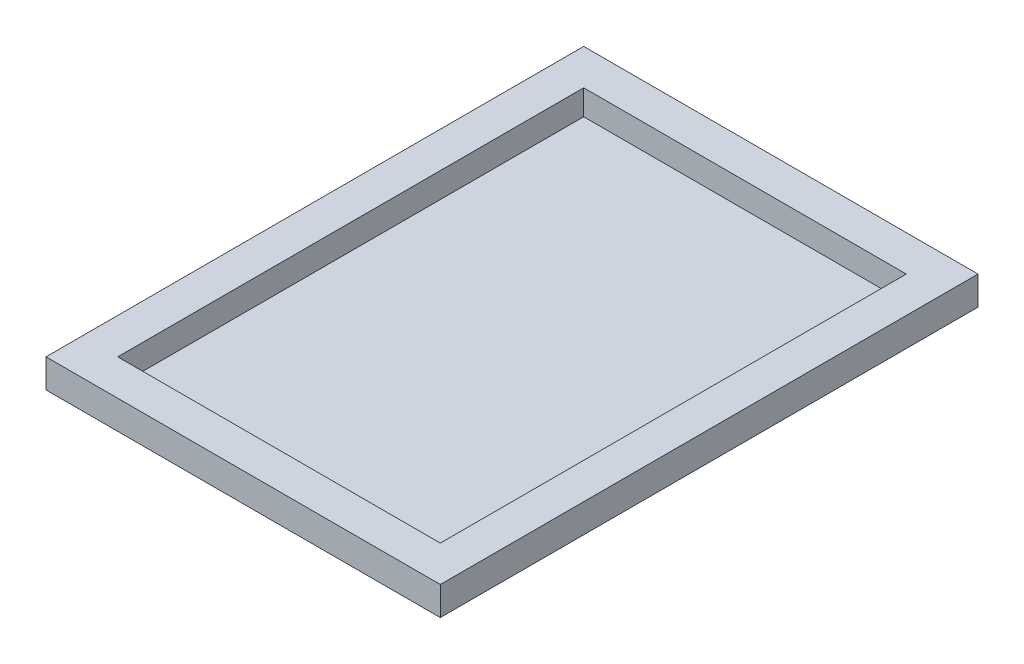
ISO-10303-21;
HEADER;
FILE_DESCRIPTION(('STEP AP214'),'2;1');
FILE_NAME('part.step','',(''),(''),'','','');
FILE_SCHEMA(('AUTOMOTIVE_DESIGN { 1 0 10303 214 1 1 1 1 }'));
ENDSEC;
DATA;
#1=APPLICATION_CONTEXT('core data for automotive mechanical design processes');
#2=APPLICATION_PROTOCOL_DEFINITION('international standard','automotive_design',2000,#1);
#3=PRODUCT_CONTEXT('',#1,'mechanical');
#4=PRODUCT('Part','Part','',(#3));
#5=PRODUCT_RELATED_PRODUCT_CATEGORY('part','',(#4));
#6=PRODUCT_DEFINITION_FORMATION('','',#4);
#7=PRODUCT_DEFINITION_CONTEXT('part definition',#1,'design');
#8=PRODUCT_DEFINITION('design','',#6,#7);
#9=PRODUCT_DEFINITION_SHAPE('','',#8);
#10=(LENGTH_UNIT() NAMED_UNIT(*) SI_UNIT(.MILLI.,.METRE.));
#11=(NAMED_UNIT(*) PLANE_ANGLE_UNIT() SI_UNIT($,.RADIAN.));
#12=(NAMED_UNIT(*) SI_UNIT($,.STERADIAN.) SOLID_ANGLE_UNIT());
#13=UNCERTAINTY_MEASURE_WITH_UNIT(LENGTH_MEASURE(1.E-05),#10,'distance_accuracy_value','');
#14=(GEOMETRIC_REPRESENTATION_CONTEXT(3) GLOBAL_UNCERTAINTY_ASSIGNED_CONTEXT((#13)) GLOBAL_UNIT_ASSIGNED_CONTEXT((#10,
#11,#12)) REPRESENTATION_CONTEXT('',''));
#15=CARTESIAN_POINT('',(0.,0.,0.));
#16=DIRECTION('',(0.,0.,1.));
#17=DIRECTION('',(1.,0.,0.));
#18=AXIS2_PLACEMENT_3D('',#15,#16,#17);
#19=CARTESIAN_POINT('',(-55.,8.,75.));
#20=DIRECTION('',(0.,1.,0.));
#21=DIRECTION('',(0.,0.,1.));
#22=AXIS2_PLACEMENT_3D('',#19,#20,#21);
#23=PLANE('',#22);
#24=DIRECTION('',(0.,0.,1.));
#25=VECTOR('',#24,1.);
#26=CARTESIAN_POINT('',(-55.,8.,-75.));
#27=LINE('',#26,#25);
#28=CARTESIAN_POINT('',(-55.,8.,-75.));
#29=VERTEX_POINT('',#28);
#30=CARTESIAN_POINT('',(-55.,8.,75.));
#31=VERTEX_POINT('',#30);
#32=EDGE_CURVE('E139',#29,#31,#27,.T.);
#33=ORIENTED_EDGE('',*,*,#32,.T.);
#34=DIRECTION('',(1.,0.,0.));
#35=VECTOR('',#34,1.);
#36=CARTESIAN_POINT('',(-55.,8.,75.));
#37=LINE('',#36,#35);
#38=CARTESIAN_POINT('',(55.,8.,75.));
#39=VERTEX_POINT('',#38);
#40=EDGE_CURVE('E142',#31,#39,#37,.T.);
#41=ORIENTED_EDGE('',*,*,#40,.T.);
#42=DIRECTION('',(0.,0.,-1.));
#43=VECTOR('',#42,1.);
#44=CARTESIAN_POINT('',(55.,8.,-75.));
#45=LINE('',#44,#43);
#46=CARTESIAN_POINT('',(55.,8.,-75.));
#47=VERTEX_POINT('',#46);
#48=EDGE_CURVE('E145',#39,#47,#45,.T.);
#49=ORIENTED_EDGE('',*,*,#48,.T.);
#50=DIRECTION('',(-1.,0.,0.));
#51=VECTOR('',#50,1.);
#52=CARTESIAN_POINT('',(-55.,8.,-75.));
#53=LINE('',#52,#51);
#54=EDGE_CURVE('E147',#47,#29,#53,.T.);
#55=ORIENTED_EDGE('',*,*,#54,.T.);
#56=EDGE_LOOP('',(#33,#41,#49,#55));
#57=FACE_BOUND('',#56,.T.);
#58=DIRECTION('',(-1.,0.,0.));
#59=VECTOR('',#58,1.);
#60=CARTESIAN_POINT('',(-45.,8.,-65.));
#61=LINE('',#60,#59);
#62=CARTESIAN_POINT('',(45.,8.,-65.));
#63=VERTEX_POINT('',#62);
#64=CARTESIAN_POINT('',(-45.,8.,-65.));
#65=VERTEX_POINT('',#64);
#66=EDGE_CURVE('E128',#63,#65,#61,.T.);
#67=ORIENTED_EDGE('',*,*,#66,.F.);
#68=DIRECTION('',(0.,0.,-1.));
#69=VECTOR('',#68,1.);
#70=CARTESIAN_POINT('',(45.,8.,-65.));
#71=LINE('',#70,#69);
#72=CARTESIAN_POINT('',(45.,8.,65.));
#73=VERTEX_POINT('',#72);
#74=EDGE_CURVE('E126',#73,#63,#71,.T.);
#75=ORIENTED_EDGE('',*,*,#74,.F.);
#76=DIRECTION('',(1.,0.,0.));
#77=VECTOR('',#76,1.);
#78=CARTESIAN_POINT('',(-45.,8.,65.));
#79=LINE('',#78,#77);
#80=CARTESIAN_POINT('',(-45.,8.,65.));
#81=VERTEX_POINT('',#80);
#82=EDGE_CURVE('E110',#81,#73,#79,.T.);
#83=ORIENTED_EDGE('',*,*,#82,.F.);
#84=DIRECTION('',(0.,0.,1.));
#85=VECTOR('',#84,1.);
#86=CARTESIAN_POINT('',(-45.,8.,-65.));
#87=LINE('',#86,#85);
#88=EDGE_CURVE('E130',#65,#81,#87,.T.);
#89=ORIENTED_EDGE('',*,*,#88,.F.);
#90=EDGE_LOOP('',(#67,#75,#83,#89));
#91=FACE_BOUND('',#90,.T.);
#92=ADVANCED_FACE('F37',(#57,#91),#23,.T.);
#93=CARTESIAN_POINT('',(-55.,0.,75.));
#94=DIRECTION('',(0.,1.,0.));
#95=DIRECTION('',(0.,0.,1.));
#96=AXIS2_PLACEMENT_3D('',#93,#94,#95);
#97=PLANE('',#96);
#98=DIRECTION('',(0.,0.,1.));
#99=VECTOR('',#98,1.);
#100=CARTESIAN_POINT('',(-55.,0.,-75.));
#101=LINE('',#100,#99);
#102=CARTESIAN_POINT('',(-55.,0.,-75.));
#103=VERTEX_POINT('',#102);
#104=CARTESIAN_POINT('',(-55.,0.,75.));
#105=VERTEX_POINT('',#104);
#106=EDGE_CURVE('E138',#103,#105,#101,.T.);
#107=ORIENTED_EDGE('',*,*,#106,.F.);
#108=DIRECTION('',(-1.,0.,0.));
#109=VECTOR('',#108,1.);
#110=CARTESIAN_POINT('',(-55.,0.,-75.));
#111=LINE('',#110,#109);
#112=CARTESIAN_POINT('',(55.,0.,-75.));
#113=VERTEX_POINT('',#112);
#114=EDGE_CURVE('E143',#113,#103,#111,.T.);
#115=ORIENTED_EDGE('',*,*,#114,.F.);
#116=DIRECTION('',(0.,0.,-1.));
#117=VECTOR('',#116,1.);
#118=CARTESIAN_POINT('',(55.,0.,-75.));
#119=LINE('',#118,#117);
#120=CARTESIAN_POINT('',(55.,0.,75.));
#121=VERTEX_POINT('',#120);
#122=EDGE_CURVE('E154',#121,#113,#119,.T.);
#123=ORIENTED_EDGE('',*,*,#122,.F.);
#124=DIRECTION('',(1.,0.,0.));
#125=VECTOR('',#124,1.);
#126=CARTESIAN_POINT('',(-55.,0.,75.));
#127=LINE('',#126,#125);
#128=EDGE_CURVE('E152',#105,#121,#127,.T.);
#129=ORIENTED_EDGE('',*,*,#128,.F.);
#130=EDGE_LOOP('',(#107,#115,#123,#129));
#131=FACE_BOUND('',#130,.T.);
#132=ADVANCED_FACE('F172',(#131),#97,.F.);
#133=CARTESIAN_POINT('',(-55.,8.,-75.));
#134=DIRECTION('',(1.,0.,0.));
#135=DIRECTION('',(0.,0.,-1.));
#136=AXIS2_PLACEMENT_3D('',#133,#134,#135);
#137=PLANE('',#136);
#138=ORIENTED_EDGE('',*,*,#106,.T.);
#139=DIRECTION('',(0.,-1.,0.));
#140=VECTOR('',#139,1.);
#141=CARTESIAN_POINT('',(-55.,8.,75.));
#142=LINE('',#141,#140);
#143=EDGE_CURVE('E11',#31,#105,#142,.T.);
#144=ORIENTED_EDGE('',*,*,#143,.F.);
#145=ORIENTED_EDGE('',*,*,#32,.F.);
#146=DIRECTION('',(0.,-1.,0.));
#147=VECTOR('',#146,1.);
#148=CARTESIAN_POINT('',(-55.,8.,-75.));
#149=LINE('',#148,#147);
#150=EDGE_CURVE('E149',#29,#103,#149,.T.);
#151=ORIENTED_EDGE('',*,*,#150,.T.);
#152=EDGE_LOOP('',(#138,#144,#145,#151));
#153=FACE_BOUND('',#152,.T.);
#154=ADVANCED_FACE('F39',(#153),#137,.F.);
#155=CARTESIAN_POINT('',(-55.,8.,75.));
#156=DIRECTION('',(0.,0.,-1.));
#157=DIRECTION('',(-1.,0.,0.));
#158=AXIS2_PLACEMENT_3D('',#155,#156,#157);
#159=PLANE('',#158);
#160=ORIENTED_EDGE('',*,*,#128,.T.);
#161=DIRECTION('',(0.,-1.,0.));
#162=VECTOR('',#161,1.);
#163=CARTESIAN_POINT('',(55.,8.,75.));
#164=LINE('',#163,#162);
#165=EDGE_CURVE('E45',#39,#121,#164,.T.);
#166=ORIENTED_EDGE('',*,*,#165,.F.);
#167=ORIENTED_EDGE('',*,*,#40,.F.);
#168=ORIENTED_EDGE('',*,*,#143,.T.);
#169=EDGE_LOOP('',(#160,#166,#167,#168));
#170=FACE_BOUND('',#169,.T.);
#171=ADVANCED_FACE('F182',(#170),#159,.F.);
#172=CARTESIAN_POINT('',(55.,8.,-75.));
#173=DIRECTION('',(-1.,0.,0.));
#174=DIRECTION('',(0.,0.,1.));
#175=AXIS2_PLACEMENT_3D('',#172,#173,#174);
#176=PLANE('',#175);
#177=ORIENTED_EDGE('',*,*,#122,.T.);
#178=DIRECTION('',(0.,-1.,0.));
#179=VECTOR('',#178,1.);
#180=CARTESIAN_POINT('',(55.,8.,-75.));
#181=LINE('',#180,#179);
#182=EDGE_CURVE('E159',#47,#113,#181,.T.);
#183=ORIENTED_EDGE('',*,*,#182,.F.);
#184=ORIENTED_EDGE('',*,*,#48,.F.);
#185=ORIENTED_EDGE('',*,*,#165,.T.);
#186=EDGE_LOOP('',(#177,#183,#184,#185));
#187=FACE_BOUND('',#186,.T.);
#188=ADVANCED_FACE('F166',(#187),#176,.F.);
#189=CARTESIAN_POINT('',(-55.,8.,-75.));
#190=DIRECTION('',(0.,0.,1.));
#191=DIRECTION('',(1.,0.,0.));
#192=AXIS2_PLACEMENT_3D('',#189,#190,#191);
#193=PLANE('',#192);
#194=ORIENTED_EDGE('',*,*,#114,.T.);
#195=ORIENTED_EDGE('',*,*,#150,.F.);
#196=ORIENTED_EDGE('',*,*,#54,.F.);
#197=ORIENTED_EDGE('',*,*,#182,.T.);
#198=EDGE_LOOP('',(#194,#195,#196,#197));
#199=FACE_BOUND('',#198,.T.);
#200=ADVANCED_FACE('F175',(#199),#193,.F.);
#201=CARTESIAN_POINT('',(45.,8.,-65.));
#202=DIRECTION('',(-1.,0.,0.));
#203=DIRECTION('',(0.,0.,1.));
#204=AXIS2_PLACEMENT_3D('',#201,#202,#203);
#205=PLANE('',#204);
#206=DIRECTION('',(0.,0.,1.));
#207=VECTOR('',#206,1.);
#208=CARTESIAN_POINT('',(45.,1.,65.));
#209=LINE('',#208,#207);
#210=CARTESIAN_POINT('',(45.,1.,-65.));
#211=VERTEX_POINT('',#210);
#212=CARTESIAN_POINT('',(45.,1.,65.));
#213=VERTEX_POINT('',#212);
#214=EDGE_CURVE('E116',#211,#213,#209,.T.);
#215=ORIENTED_EDGE('',*,*,#214,.T.);
#216=DIRECTION('',(0.,-1.,0.));
#217=VECTOR('',#216,1.);
#218=CARTESIAN_POINT('',(45.,8.,65.));
#219=LINE('',#218,#217);
#220=EDGE_CURVE('E104',#73,#213,#219,.T.);
#221=ORIENTED_EDGE('',*,*,#220,.F.);
#222=ORIENTED_EDGE('',*,*,#74,.T.);
#223=DIRECTION('',(0.,-1.,0.));
#224=VECTOR('',#223,1.);
#225=CARTESIAN_POINT('',(45.,8.,-65.));
#226=LINE('',#225,#224);
#227=EDGE_CURVE('E118',#63,#211,#226,.T.);
#228=ORIENTED_EDGE('',*,*,#227,.T.);
#229=EDGE_LOOP('',(#215,#221,#222,#228));
#230=FACE_BOUND('',#229,.T.);
#231=ADVANCED_FACE('F117',(#230),#205,.T.);
#232=CARTESIAN_POINT('',(-45.,8.,-65.));
#233=DIRECTION('',(0.,0.,1.));
#234=DIRECTION('',(1.,0.,0.));
#235=AXIS2_PLACEMENT_3D('',#232,#233,#234);
#236=PLANE('',#235);
#237=DIRECTION('',(1.,0.,0.));
#238=VECTOR('',#237,1.);
#239=CARTESIAN_POINT('',(45.,1.,-65.));
#240=LINE('',#239,#238);
#241=CARTESIAN_POINT('',(-45.,1.,-65.));
#242=VERTEX_POINT('',#241);
#243=EDGE_CURVE('E52',#242,#211,#240,.T.);
#244=ORIENTED_EDGE('',*,*,#243,.T.);
#245=ORIENTED_EDGE('',*,*,#227,.F.);
#246=ORIENTED_EDGE('',*,*,#66,.T.);
#247=DIRECTION('',(0.,-1.,0.));
#248=VECTOR('',#247,1.);
#249=CARTESIAN_POINT('',(-45.,8.,-65.));
#250=LINE('',#249,#248);
#251=EDGE_CURVE('E135',#65,#242,#250,.T.);
#252=ORIENTED_EDGE('',*,*,#251,.T.);
#253=EDGE_LOOP('',(#244,#245,#246,#252));
#254=FACE_BOUND('',#253,.T.);
#255=ADVANCED_FACE('F202',(#254),#236,.T.);
#256=CARTESIAN_POINT('',(-45.,8.,-65.));
#257=DIRECTION('',(1.,0.,0.));
#258=DIRECTION('',(0.,0.,-1.));
#259=AXIS2_PLACEMENT_3D('',#256,#257,#258);
#260=PLANE('',#259);
#261=DIRECTION('',(0.,0.,-1.));
#262=VECTOR('',#261,1.);
#263=CARTESIAN_POINT('',(-45.,1.,-65.));
#264=LINE('',#263,#262);
#265=CARTESIAN_POINT('',(-45.,1.,65.));
#266=VERTEX_POINT('',#265);
#267=EDGE_CURVE('E60',#266,#242,#264,.T.);
#268=ORIENTED_EDGE('',*,*,#267,.T.);
#269=ORIENTED_EDGE('',*,*,#251,.F.);
#270=ORIENTED_EDGE('',*,*,#88,.T.);
#271=DIRECTION('',(0.,-1.,0.));
#272=VECTOR('',#271,1.);
#273=CARTESIAN_POINT('',(-45.,8.,65.));
#274=LINE('',#273,#272);
#275=EDGE_CURVE('E113',#81,#266,#274,.T.);
#276=ORIENTED_EDGE('',*,*,#275,.T.);
#277=EDGE_LOOP('',(#268,#269,#270,#276));
#278=FACE_BOUND('',#277,.T.);
#279=ADVANCED_FACE('F206',(#278),#260,.T.);
#280=CARTESIAN_POINT('',(-45.,8.,65.));
#281=DIRECTION('',(0.,0.,-1.));
#282=DIRECTION('',(-1.,0.,0.));
#283=AXIS2_PLACEMENT_3D('',#280,#281,#282);
#284=PLANE('',#283);
#285=DIRECTION('',(-1.,0.,0.));
#286=VECTOR('',#285,1.);
#287=CARTESIAN_POINT('',(-45.,1.,65.));
#288=LINE('',#287,#286);
#289=EDGE_CURVE('E108',#213,#266,#288,.T.);
#290=ORIENTED_EDGE('',*,*,#289,.T.);
#291=ORIENTED_EDGE('',*,*,#275,.F.);
#292=ORIENTED_EDGE('',*,*,#82,.T.);
#293=ORIENTED_EDGE('',*,*,#220,.T.);
#294=EDGE_LOOP('',(#290,#291,#292,#293));
#295=FACE_BOUND('',#294,.T.);
#296=ADVANCED_FACE('F106',(#295),#284,.T.);
#297=CARTESIAN_POINT('',(45.,1.,-65.));
#298=DIRECTION('',(0.,1.,0.));
#299=DIRECTION('',(0.,0.,1.));
#300=AXIS2_PLACEMENT_3D('',#297,#298,#299);
#301=PLANE('',#300);
#302=ORIENTED_EDGE('',*,*,#214,.F.);
#303=ORIENTED_EDGE('',*,*,#243,.F.);
#304=ORIENTED_EDGE('',*,*,#267,.F.);
#305=ORIENTED_EDGE('',*,*,#289,.F.);
#306=EDGE_LOOP('',(#302,#303,#304,#305));
#307=FACE_BOUND('',#306,.T.);
#308=ADVANCED_FACE('F121',(#307),#301,.T.);
#309=CLOSED_SHELL('',(#92,#132,#154,#171,#188,#200,#231,#255,#279,#296,#308));
#310=MANIFOLD_SOLID_BREP('B2',#309);
#311=ADVANCED_BREP_SHAPE_REPRESENTATION('',(#18,#310),#14);
#312=SHAPE_DEFINITION_REPRESENTATION(#9,#311);
ENDSEC;
END-ISO-10303-21;
